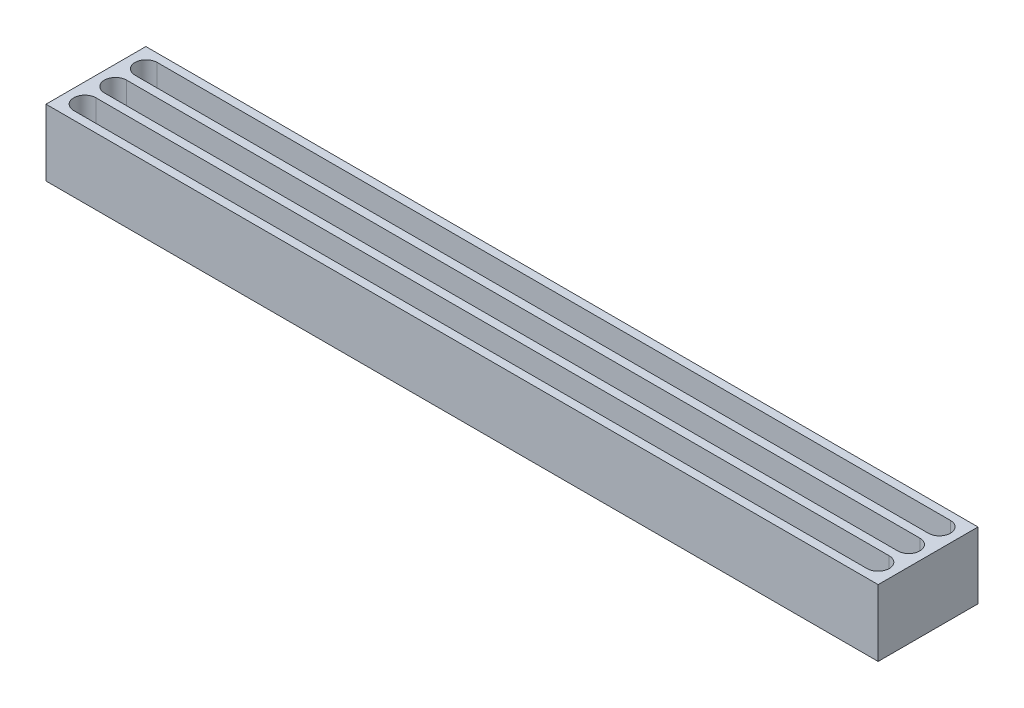
ISO-10303-21;
HEADER;
FILE_DESCRIPTION(('STEP AP214'),'2;1');
FILE_NAME('part.step','',(''),(''),'','','');
FILE_SCHEMA(('AUTOMOTIVE_DESIGN { 1 0 10303 214 1 1 1 1 }'));
ENDSEC;
DATA;
#1=APPLICATION_CONTEXT('core data for automotive mechanical design processes');
#2=APPLICATION_PROTOCOL_DEFINITION('international standard','automotive_design',2000,#1);
#3=PRODUCT_CONTEXT('',#1,'mechanical');
#4=PRODUCT('Part','Part','',(#3));
#5=PRODUCT_RELATED_PRODUCT_CATEGORY('part','',(#4));
#6=PRODUCT_DEFINITION_FORMATION('','',#4);
#7=PRODUCT_DEFINITION_CONTEXT('part definition',#1,'design');
#8=PRODUCT_DEFINITION('design','',#6,#7);
#9=PRODUCT_DEFINITION_SHAPE('','',#8);
#10=(LENGTH_UNIT() NAMED_UNIT(*) SI_UNIT(.MILLI.,.METRE.));
#11=(NAMED_UNIT(*) PLANE_ANGLE_UNIT() SI_UNIT($,.RADIAN.));
#12=(NAMED_UNIT(*) SI_UNIT($,.STERADIAN.) SOLID_ANGLE_UNIT());
#13=UNCERTAINTY_MEASURE_WITH_UNIT(LENGTH_MEASURE(1.E-05),#10,'distance_accuracy_value','');
#14=(GEOMETRIC_REPRESENTATION_CONTEXT(3) GLOBAL_UNCERTAINTY_ASSIGNED_CONTEXT((#13)) GLOBAL_UNIT_ASSIGNED_CONTEXT((#10,
#11,#12)) REPRESENTATION_CONTEXT('',''));
#15=CARTESIAN_POINT('',(0.,0.,0.));
#16=DIRECTION('',(0.,0.,1.));
#17=DIRECTION('',(1.,0.,0.));
#18=AXIS2_PLACEMENT_3D('',#15,#16,#17);
#19=CARTESIAN_POINT('',(-317.5,-50.8,38.1));
#20=DIRECTION('',(-1.,0.,0.));
#21=DIRECTION('',(0.,0.,1.));
#22=AXIS2_PLACEMENT_3D('',#19,#20,#21);
#23=PLANE('',#22);
#24=DIRECTION('',(0.,0.,1.));
#25=VECTOR('',#24,1.);
#26=CARTESIAN_POINT('',(-317.5,0.,38.1));
#27=LINE('',#26,#25);
#28=CARTESIAN_POINT('',(-317.5,0.,-38.1));
#29=VERTEX_POINT('',#28);
#30=CARTESIAN_POINT('',(-317.5,0.,38.1));
#31=VERTEX_POINT('',#30);
#32=EDGE_CURVE('E280',#29,#31,#27,.T.);
#33=ORIENTED_EDGE('',*,*,#32,.F.);
#34=DIRECTION('',(0.,1.,0.));
#35=VECTOR('',#34,1.);
#36=CARTESIAN_POINT('',(-317.5,-50.8,-38.1));
#37=LINE('',#36,#35);
#38=CARTESIAN_POINT('',(-317.5,-50.8,-38.1));
#39=VERTEX_POINT('',#38);
#40=EDGE_CURVE('E11',#39,#29,#37,.T.);
#41=ORIENTED_EDGE('',*,*,#40,.F.);
#42=DIRECTION('',(0.,0.,1.));
#43=VECTOR('',#42,1.);
#44=CARTESIAN_POINT('',(-317.5,-50.8,38.1));
#45=LINE('',#44,#43);
#46=CARTESIAN_POINT('',(-317.5,-50.8,38.1));
#47=VERTEX_POINT('',#46);
#48=EDGE_CURVE('E290',#39,#47,#45,.T.);
#49=ORIENTED_EDGE('',*,*,#48,.T.);
#50=DIRECTION('',(0.,1.,0.));
#51=VECTOR('',#50,1.);
#52=CARTESIAN_POINT('',(-317.5,-50.8,38.1));
#53=LINE('',#52,#51);
#54=EDGE_CURVE('E42',#47,#31,#53,.T.);
#55=ORIENTED_EDGE('',*,*,#54,.T.);
#56=EDGE_LOOP('',(#33,#41,#49,#55));
#57=FACE_BOUND('',#56,.T.);
#58=ADVANCED_FACE('F39',(#57),#23,.T.);
#59=CARTESIAN_POINT('',(317.5,-50.8,-38.1));
#60=DIRECTION('',(0.,0.,-1.));
#61=DIRECTION('',(-1.,0.,0.));
#62=AXIS2_PLACEMENT_3D('',#59,#60,#61);
#63=PLANE('',#62);
#64=DIRECTION('',(-1.,0.,0.));
#65=VECTOR('',#64,1.);
#66=CARTESIAN_POINT('',(317.5,0.,-38.1));
#67=LINE('',#66,#65);
#68=CARTESIAN_POINT('',(317.5,0.,-38.1));
#69=VERTEX_POINT('',#68);
#70=EDGE_CURVE('E295',#69,#29,#67,.T.);
#71=ORIENTED_EDGE('',*,*,#70,.F.);
#72=DIRECTION('',(0.,1.,0.));
#73=VECTOR('',#72,1.);
#74=CARTESIAN_POINT('',(317.5,-50.8,-38.1));
#75=LINE('',#74,#73);
#76=CARTESIAN_POINT('',(317.5,-50.8,-38.1));
#77=VERTEX_POINT('',#76);
#78=EDGE_CURVE('E48',#77,#69,#75,.T.);
#79=ORIENTED_EDGE('',*,*,#78,.F.);
#80=DIRECTION('',(-1.,0.,0.));
#81=VECTOR('',#80,1.);
#82=CARTESIAN_POINT('',(317.5,-50.8,-38.1));
#83=LINE('',#82,#81);
#84=EDGE_CURVE('E303',#77,#39,#83,.T.);
#85=ORIENTED_EDGE('',*,*,#84,.T.);
#86=ORIENTED_EDGE('',*,*,#40,.T.);
#87=EDGE_LOOP('',(#71,#79,#85,#86));
#88=FACE_BOUND('',#87,.T.);
#89=ADVANCED_FACE('F337',(#88),#63,.T.);
#90=CARTESIAN_POINT('',(317.5,-50.8,38.1));
#91=DIRECTION('',(1.,0.,0.));
#92=DIRECTION('',(0.,0.,-1.));
#93=AXIS2_PLACEMENT_3D('',#90,#91,#92);
#94=PLANE('',#93);
#95=DIRECTION('',(0.,0.,-1.));
#96=VECTOR('',#95,1.);
#97=CARTESIAN_POINT('',(317.5,0.,38.1));
#98=LINE('',#97,#96);
#99=CARTESIAN_POINT('',(317.5,0.,38.1));
#100=VERTEX_POINT('',#99);
#101=EDGE_CURVE('E314',#100,#69,#98,.T.);
#102=ORIENTED_EDGE('',*,*,#101,.F.);
#103=DIRECTION('',(0.,1.,0.));
#104=VECTOR('',#103,1.);
#105=CARTESIAN_POINT('',(317.5,-50.8,38.1));
#106=LINE('',#105,#104);
#107=CARTESIAN_POINT('',(317.5,-50.8,38.1));
#108=VERTEX_POINT('',#107);
#109=EDGE_CURVE('E322',#108,#100,#106,.T.);
#110=ORIENTED_EDGE('',*,*,#109,.F.);
#111=DIRECTION('',(0.,0.,-1.));
#112=VECTOR('',#111,1.);
#113=CARTESIAN_POINT('',(317.5,-50.8,38.1));
#114=LINE('',#113,#112);
#115=EDGE_CURVE('E299',#108,#77,#114,.T.);
#116=ORIENTED_EDGE('',*,*,#115,.T.);
#117=ORIENTED_EDGE('',*,*,#78,.T.);
#118=EDGE_LOOP('',(#102,#110,#116,#117));
#119=FACE_BOUND('',#118,.T.);
#120=ADVANCED_FACE('F342',(#119),#94,.T.);
#121=CARTESIAN_POINT('',(317.5,-50.8,38.1));
#122=DIRECTION('',(0.,0.,1.));
#123=DIRECTION('',(1.,0.,0.));
#124=AXIS2_PLACEMENT_3D('',#121,#122,#123);
#125=PLANE('',#124);
#126=DIRECTION('',(1.,0.,0.));
#127=VECTOR('',#126,1.);
#128=CARTESIAN_POINT('',(317.5,0.,38.1));
#129=LINE('',#128,#127);
#130=EDGE_CURVE('E310',#31,#100,#129,.T.);
#131=ORIENTED_EDGE('',*,*,#130,.F.);
#132=ORIENTED_EDGE('',*,*,#54,.F.);
#133=DIRECTION('',(1.,0.,0.));
#134=VECTOR('',#133,1.);
#135=CARTESIAN_POINT('',(317.5,-50.8,38.1));
#136=LINE('',#135,#134);
#137=EDGE_CURVE('E294',#47,#108,#136,.T.);
#138=ORIENTED_EDGE('',*,*,#137,.T.);
#139=ORIENTED_EDGE('',*,*,#109,.T.);
#140=EDGE_LOOP('',(#131,#132,#138,#139));
#141=FACE_BOUND('',#140,.T.);
#142=ADVANCED_FACE('F332',(#141),#125,.T.);
#143=CARTESIAN_POINT('',(0.,-50.8,0.));
#144=DIRECTION('',(0.,1.,0.));
#145=DIRECTION('',(0.,0.,1.));
#146=AXIS2_PLACEMENT_3D('',#143,#144,#145);
#147=PLANE('',#146);
#148=DIRECTION('',(1.,0.,0.));
#149=VECTOR('',#148,1.);
#150=CARTESIAN_POINT('',(302.683333333333,-50.8,-14.9860000000001));
#151=LINE('',#150,#149);
#152=CARTESIAN_POINT('',(-302.683333333333,-50.8,-14.986));
#153=VERTEX_POINT('',#152);
#154=CARTESIAN_POINT('',(302.683333333333,-50.8,-14.9860000000001));
#155=VERTEX_POINT('',#154);
#156=EDGE_CURVE('E162',#153,#155,#151,.T.);
#157=ORIENTED_EDGE('',*,*,#156,.T.);
#158=CARTESIAN_POINT('',(302.683333333333,-50.8,-23.4526666666667));
#159=DIRECTION('',(0.,1.,0.));
#160=DIRECTION('',(0.,0.,1.));
#161=AXIS2_PLACEMENT_3D('',#158,#159,#160);
#162=CIRCLE('',#161,8.46666666666667);
#163=CARTESIAN_POINT('',(302.683333333333,-50.8,-31.9193333333335));
#164=VERTEX_POINT('',#163);
#165=EDGE_CURVE('E155',#155,#164,#162,.T.);
#166=ORIENTED_EDGE('',*,*,#165,.T.);
#167=DIRECTION('',(-1.,0.,0.));
#168=VECTOR('',#167,1.);
#169=CARTESIAN_POINT('',(302.683333333333,-50.8,-31.9193333333335));
#170=LINE('',#169,#168);
#171=CARTESIAN_POINT('',(-302.683333333333,-50.8,-31.9193333333333));
#172=VERTEX_POINT('',#171);
#173=EDGE_CURVE('E165',#164,#172,#170,.T.);
#174=ORIENTED_EDGE('',*,*,#173,.T.);
#175=CARTESIAN_POINT('',(-302.683333333333,-50.8,-23.4526666666667));
#176=DIRECTION('',(0.,1.,0.));
#177=DIRECTION('',(0.,0.,1.));
#178=AXIS2_PLACEMENT_3D('',#175,#176,#177);
#179=CIRCLE('',#178,8.46666666666667);
#180=EDGE_CURVE('E56',#172,#153,#179,.T.);
#181=ORIENTED_EDGE('',*,*,#180,.T.);
#182=EDGE_LOOP('',(#157,#166,#174,#181));
#183=FACE_BOUND('',#182,.T.);
#184=DIRECTION('',(1.,0.,0.));
#185=VECTOR('',#184,1.);
#186=CARTESIAN_POINT('',(302.683333333333,-50.8,8.38199999999986));
#187=LINE('',#186,#185);
#188=CARTESIAN_POINT('',(-302.683333333333,-50.8,8.38200000000005));
#189=VERTEX_POINT('',#188);
#190=CARTESIAN_POINT('',(302.683333333333,-50.8,8.38199999999986));
#191=VERTEX_POINT('',#190);
#192=EDGE_CURVE('E215',#189,#191,#187,.T.);
#193=ORIENTED_EDGE('',*,*,#192,.T.);
#194=CARTESIAN_POINT('',(302.683333333333,-50.8,-0.0846666666666634));
#195=DIRECTION('',(0.,1.,0.));
#196=DIRECTION('',(0.,0.,1.));
#197=AXIS2_PLACEMENT_3D('',#194,#195,#196);
#198=CIRCLE('',#197,8.46666666666667);
#199=CARTESIAN_POINT('',(302.683333333333,-50.8,-8.55133333333349));
#200=VERTEX_POINT('',#199);
#201=EDGE_CURVE('E202',#191,#200,#198,.T.);
#202=ORIENTED_EDGE('',*,*,#201,.T.);
#203=DIRECTION('',(-1.,0.,0.));
#204=VECTOR('',#203,1.);
#205=CARTESIAN_POINT('',(302.683333333333,-50.8,-8.55133333333349));
#206=LINE('',#205,#204);
#207=CARTESIAN_POINT('',(-302.683333333333,-50.8,-8.5513333333333));
#208=VERTEX_POINT('',#207);
#209=EDGE_CURVE('E206',#200,#208,#206,.T.);
#210=ORIENTED_EDGE('',*,*,#209,.T.);
#211=CARTESIAN_POINT('',(-302.683333333333,-50.8,-0.0846666666666634));
#212=DIRECTION('',(0.,1.,0.));
#213=DIRECTION('',(0.,0.,1.));
#214=AXIS2_PLACEMENT_3D('',#211,#212,#213);
#215=CIRCLE('',#214,8.46666666666668);
#216=EDGE_CURVE('E211',#208,#189,#215,.T.);
#217=ORIENTED_EDGE('',*,*,#216,.T.);
#218=EDGE_LOOP('',(#193,#202,#210,#217));
#219=FACE_BOUND('',#218,.T.);
#220=DIRECTION('',(1.,0.,0.));
#221=VECTOR('',#220,1.);
#222=CARTESIAN_POINT('',(302.683333333333,-50.8,31.7499999999999));
#223=LINE('',#222,#221);
#224=CARTESIAN_POINT('',(-302.683333333333,-50.8,31.75));
#225=VERTEX_POINT('',#224);
#226=CARTESIAN_POINT('',(302.683333333333,-50.8,31.7499999999999));
#227=VERTEX_POINT('',#226);
#228=EDGE_CURVE('E259',#225,#227,#223,.T.);
#229=ORIENTED_EDGE('',*,*,#228,.T.);
#230=CARTESIAN_POINT('',(302.683333333333,-50.8,23.2833333333333));
#231=DIRECTION('',(0.,1.,0.));
#232=DIRECTION('',(0.,0.,1.));
#233=AXIS2_PLACEMENT_3D('',#230,#231,#232);
#234=CIRCLE('',#233,8.46666666666667);
#235=CARTESIAN_POINT('',(302.683333333333,-50.8,14.8166666666665));
#236=VERTEX_POINT('',#235);
#237=EDGE_CURVE('E246',#227,#236,#234,.T.);
#238=ORIENTED_EDGE('',*,*,#237,.T.);
#239=DIRECTION('',(-1.,0.,0.));
#240=VECTOR('',#239,1.);
#241=CARTESIAN_POINT('',(302.683333333333,-50.8,14.8166666666665));
#242=LINE('',#241,#240);
#243=CARTESIAN_POINT('',(-302.683333333333,-50.8,14.8166666666667));
#244=VERTEX_POINT('',#243);
#245=EDGE_CURVE('E250',#236,#244,#242,.T.);
#246=ORIENTED_EDGE('',*,*,#245,.T.);
#247=CARTESIAN_POINT('',(-302.683333333333,-50.8,23.2833333333333));
#248=DIRECTION('',(0.,1.,0.));
#249=DIRECTION('',(0.,0.,1.));
#250=AXIS2_PLACEMENT_3D('',#247,#248,#249);
#251=CIRCLE('',#250,8.46666666666668);
#252=EDGE_CURVE('E255',#244,#225,#251,.T.);
#253=ORIENTED_EDGE('',*,*,#252,.T.);
#254=EDGE_LOOP('',(#229,#238,#246,#253));
#255=FACE_BOUND('',#254,.T.);
#256=ORIENTED_EDGE('',*,*,#48,.F.);
#257=ORIENTED_EDGE('',*,*,#84,.F.);
#258=ORIENTED_EDGE('',*,*,#115,.F.);
#259=ORIENTED_EDGE('',*,*,#137,.F.);
#260=EDGE_LOOP('',(#256,#257,#258,#259));
#261=FACE_BOUND('',#260,.T.);
#262=ADVANCED_FACE('F170',(#183,#219,#255,#261),#147,.F.);
#263=CARTESIAN_POINT('',(0.,0.,0.));
#264=DIRECTION('',(0.,1.,0.));
#265=DIRECTION('',(0.,0.,1.));
#266=AXIS2_PLACEMENT_3D('',#263,#264,#265);
#267=PLANE('',#266);
#268=CARTESIAN_POINT('',(302.683333333333,0.,-23.4526666666667));
#269=DIRECTION('',(0.,1.,0.));
#270=DIRECTION('',(0.,0.,1.));
#271=AXIS2_PLACEMENT_3D('',#268,#269,#270);
#272=CIRCLE('',#271,8.46666666666667);
#273=CARTESIAN_POINT('',(302.683333333333,0.,-14.9860000000001));
#274=VERTEX_POINT('',#273);
#275=CARTESIAN_POINT('',(302.683333333333,0.,-31.9193333333335));
#276=VERTEX_POINT('',#275);
#277=EDGE_CURVE('E64',#274,#276,#272,.T.);
#278=ORIENTED_EDGE('',*,*,#277,.F.);
#279=DIRECTION('',(1.,0.,0.));
#280=VECTOR('',#279,1.);
#281=CARTESIAN_POINT('',(302.683333333333,0.,-14.9860000000001));
#282=LINE('',#281,#280);
#283=CARTESIAN_POINT('',(-302.683333333333,0.,-14.986));
#284=VERTEX_POINT('',#283);
#285=EDGE_CURVE('E174',#284,#274,#282,.T.);
#286=ORIENTED_EDGE('',*,*,#285,.F.);
#287=CARTESIAN_POINT('',(-302.683333333333,0.,-23.4526666666667));
#288=DIRECTION('',(0.,1.,0.));
#289=DIRECTION('',(0.,0.,1.));
#290=AXIS2_PLACEMENT_3D('',#287,#288,#289);
#291=CIRCLE('',#290,8.46666666666667);
#292=CARTESIAN_POINT('',(-302.683333333333,0.,-31.9193333333333));
#293=VERTEX_POINT('',#292);
#294=EDGE_CURVE('E178',#293,#284,#291,.T.);
#295=ORIENTED_EDGE('',*,*,#294,.F.);
#296=DIRECTION('',(-1.,0.,0.));
#297=VECTOR('',#296,1.);
#298=CARTESIAN_POINT('',(302.683333333333,0.,-31.9193333333335));
#299=LINE('',#298,#297);
#300=EDGE_CURVE('E187',#276,#293,#299,.T.);
#301=ORIENTED_EDGE('',*,*,#300,.F.);
#302=EDGE_LOOP('',(#278,#286,#295,#301));
#303=FACE_BOUND('',#302,.T.);
#304=CARTESIAN_POINT('',(302.683333333333,0.,-0.0846666666666634));
#305=DIRECTION('',(0.,1.,0.));
#306=DIRECTION('',(0.,0.,1.));
#307=AXIS2_PLACEMENT_3D('',#304,#305,#306);
#308=CIRCLE('',#307,8.46666666666667);
#309=CARTESIAN_POINT('',(302.683333333333,0.,8.38199999999986));
#310=VERTEX_POINT('',#309);
#311=CARTESIAN_POINT('',(302.683333333333,0.,-8.55133333333349));
#312=VERTEX_POINT('',#311);
#313=EDGE_CURVE('E196',#310,#312,#308,.T.);
#314=ORIENTED_EDGE('',*,*,#313,.F.);
#315=DIRECTION('',(1.,0.,0.));
#316=VECTOR('',#315,1.);
#317=CARTESIAN_POINT('',(302.683333333333,0.,8.38199999999986));
#318=LINE('',#317,#316);
#319=CARTESIAN_POINT('',(-302.683333333333,0.,8.38200000000005));
#320=VERTEX_POINT('',#319);
#321=EDGE_CURVE('E207',#320,#310,#318,.T.);
#322=ORIENTED_EDGE('',*,*,#321,.F.);
#323=CARTESIAN_POINT('',(-302.683333333333,0.,-0.0846666666666634));
#324=DIRECTION('',(0.,1.,0.));
#325=DIRECTION('',(0.,0.,1.));
#326=AXIS2_PLACEMENT_3D('',#323,#324,#325);
#327=CIRCLE('',#326,8.46666666666668);
#328=CARTESIAN_POINT('',(-302.683333333333,0.,-8.55133333333334));
#329=VERTEX_POINT('',#328);
#330=EDGE_CURVE('E226',#329,#320,#327,.T.);
#331=ORIENTED_EDGE('',*,*,#330,.F.);
#332=DIRECTION('',(-1.,0.,0.));
#333=VECTOR('',#332,1.);
#334=CARTESIAN_POINT('',(302.683333333333,0.,-8.55133333333349));
#335=LINE('',#334,#333);
#336=EDGE_CURVE('E222',#312,#329,#335,.T.);
#337=ORIENTED_EDGE('',*,*,#336,.F.);
#338=EDGE_LOOP('',(#314,#322,#331,#337));
#339=FACE_BOUND('',#338,.T.);
#340=CARTESIAN_POINT('',(302.683333333333,0.,23.2833333333333));
#341=DIRECTION('',(0.,1.,0.));
#342=DIRECTION('',(0.,0.,1.));
#343=AXIS2_PLACEMENT_3D('',#340,#341,#342);
#344=CIRCLE('',#343,8.46666666666667);
#345=CARTESIAN_POINT('',(302.683333333333,0.,31.7499999999999));
#346=VERTEX_POINT('',#345);
#347=CARTESIAN_POINT('',(302.683333333333,0.,14.8166666666665));
#348=VERTEX_POINT('',#347);
#349=EDGE_CURVE('E236',#346,#348,#344,.T.);
#350=ORIENTED_EDGE('',*,*,#349,.F.);
#351=DIRECTION('',(1.,0.,0.));
#352=VECTOR('',#351,1.);
#353=CARTESIAN_POINT('',(302.683333333333,0.,31.7499999999999));
#354=LINE('',#353,#352);
#355=CARTESIAN_POINT('',(-302.683333333333,0.,31.75));
#356=VERTEX_POINT('',#355);
#357=EDGE_CURVE('E251',#356,#346,#354,.T.);
#358=ORIENTED_EDGE('',*,*,#357,.F.);
#359=CARTESIAN_POINT('',(-302.683333333333,0.,23.2833333333333));
#360=DIRECTION('',(0.,1.,0.));
#361=DIRECTION('',(0.,0.,1.));
#362=AXIS2_PLACEMENT_3D('',#359,#360,#361);
#363=CIRCLE('',#362,8.46666666666668);
#364=CARTESIAN_POINT('',(-302.683333333333,0.,14.8166666666667));
#365=VERTEX_POINT('',#364);
#366=EDGE_CURVE('E270',#365,#356,#363,.T.);
#367=ORIENTED_EDGE('',*,*,#366,.F.);
#368=DIRECTION('',(-1.,0.,0.));
#369=VECTOR('',#368,1.);
#370=CARTESIAN_POINT('',(302.683333333333,0.,14.8166666666665));
#371=LINE('',#370,#369);
#372=EDGE_CURVE('E266',#348,#365,#371,.T.);
#373=ORIENTED_EDGE('',*,*,#372,.F.);
#374=EDGE_LOOP('',(#350,#358,#367,#373));
#375=FACE_BOUND('',#374,.T.);
#376=ORIENTED_EDGE('',*,*,#32,.T.);
#377=ORIENTED_EDGE('',*,*,#130,.T.);
#378=ORIENTED_EDGE('',*,*,#101,.T.);
#379=ORIENTED_EDGE('',*,*,#70,.T.);
#380=EDGE_LOOP('',(#376,#377,#378,#379));
#381=FACE_BOUND('',#380,.T.);
#382=ADVANCED_FACE('F334',(#303,#339,#375,#381),#267,.T.);
#383=CARTESIAN_POINT('',(302.683333333333,-50.8,23.2833333333333));
#384=DIRECTION('',(0.,1.,0.));
#385=DIRECTION('',(0.,0.,1.));
#386=AXIS2_PLACEMENT_3D('',#383,#384,#385);
#387=CYLINDRICAL_SURFACE('',#386,8.46666666666667);
#388=ORIENTED_EDGE('',*,*,#349,.T.);
#389=DIRECTION('',(0.,1.,0.));
#390=VECTOR('',#389,1.);
#391=CARTESIAN_POINT('',(302.683333333333,-50.8,14.8166666666665));
#392=LINE('',#391,#390);
#393=EDGE_CURVE('E263',#236,#348,#392,.T.);
#394=ORIENTED_EDGE('',*,*,#393,.F.);
#395=ORIENTED_EDGE('',*,*,#237,.F.);
#396=DIRECTION('',(0.,1.,0.));
#397=VECTOR('',#396,1.);
#398=CARTESIAN_POINT('',(302.683333333333,-50.8,31.7499999999999));
#399=LINE('',#398,#397);
#400=EDGE_CURVE('E277',#227,#346,#399,.T.);
#401=ORIENTED_EDGE('',*,*,#400,.T.);
#402=EDGE_LOOP('',(#388,#394,#395,#401));
#403=FACE_BOUND('',#402,.T.);
#404=ADVANCED_FACE('F384',(#403),#387,.F.);
#405=CARTESIAN_POINT('',(302.683333333333,-50.8,31.7499999999999));
#406=DIRECTION('',(0.,0.,1.));
#407=DIRECTION('',(1.,0.,0.));
#408=AXIS2_PLACEMENT_3D('',#405,#406,#407);
#409=PLANE('',#408);
#410=ORIENTED_EDGE('',*,*,#357,.T.);
#411=ORIENTED_EDGE('',*,*,#400,.F.);
#412=ORIENTED_EDGE('',*,*,#228,.F.);
#413=DIRECTION('',(0.,1.,0.));
#414=VECTOR('',#413,1.);
#415=CARTESIAN_POINT('',(-302.683333333333,-50.8,31.75));
#416=LINE('',#415,#414);
#417=EDGE_CURVE('E281',#225,#356,#416,.T.);
#418=ORIENTED_EDGE('',*,*,#417,.T.);
#419=EDGE_LOOP('',(#410,#411,#412,#418));
#420=FACE_BOUND('',#419,.T.);
#421=ADVANCED_FACE('F394',(#420),#409,.F.);
#422=CARTESIAN_POINT('',(-302.683333333333,-50.8,23.2833333333333));
#423=DIRECTION('',(0.,1.,0.));
#424=DIRECTION('',(0.,0.,1.));
#425=AXIS2_PLACEMENT_3D('',#422,#423,#424);
#426=CYLINDRICAL_SURFACE('',#425,8.46666666666668);
#427=ORIENTED_EDGE('',*,*,#366,.T.);
#428=ORIENTED_EDGE('',*,*,#417,.F.);
#429=ORIENTED_EDGE('',*,*,#252,.F.);
#430=DIRECTION('',(0.,1.,0.));
#431=VECTOR('',#430,1.);
#432=CARTESIAN_POINT('',(-302.683333333333,-50.8,14.8166666666667));
#433=LINE('',#432,#431);
#434=EDGE_CURVE('E284',#244,#365,#433,.T.);
#435=ORIENTED_EDGE('',*,*,#434,.T.);
#436=EDGE_LOOP('',(#427,#428,#429,#435));
#437=FACE_BOUND('',#436,.T.);
#438=ADVANCED_FACE('F404',(#437),#426,.F.);
#439=CARTESIAN_POINT('',(302.683333333333,-50.8,14.8166666666665));
#440=DIRECTION('',(0.,0.,-1.));
#441=DIRECTION('',(-1.,0.,0.));
#442=AXIS2_PLACEMENT_3D('',#439,#440,#441);
#443=PLANE('',#442);
#444=ORIENTED_EDGE('',*,*,#372,.T.);
#445=ORIENTED_EDGE('',*,*,#434,.F.);
#446=ORIENTED_EDGE('',*,*,#245,.F.);
#447=ORIENTED_EDGE('',*,*,#393,.T.);
#448=EDGE_LOOP('',(#444,#445,#446,#447));
#449=FACE_BOUND('',#448,.T.);
#450=ADVANCED_FACE('F414',(#449),#443,.F.);
#451=CARTESIAN_POINT('',(302.683333333333,-50.8,-0.0846666666666634));
#452=DIRECTION('',(0.,1.,0.));
#453=DIRECTION('',(0.,0.,1.));
#454=AXIS2_PLACEMENT_3D('',#451,#452,#453);
#455=CYLINDRICAL_SURFACE('',#454,8.46666666666667);
#456=ORIENTED_EDGE('',*,*,#313,.T.);
#457=DIRECTION('',(0.,1.,0.));
#458=VECTOR('',#457,1.);
#459=CARTESIAN_POINT('',(302.683333333333,-50.8,-8.55133333333349));
#460=LINE('',#459,#458);
#461=EDGE_CURVE('E219',#200,#312,#460,.T.);
#462=ORIENTED_EDGE('',*,*,#461,.F.);
#463=ORIENTED_EDGE('',*,*,#201,.F.);
#464=DIRECTION('',(0.,1.,0.));
#465=VECTOR('',#464,1.);
#466=CARTESIAN_POINT('',(302.683333333333,-50.8,8.38199999999986));
#467=LINE('',#466,#465);
#468=EDGE_CURVE('E233',#191,#310,#467,.T.);
#469=ORIENTED_EDGE('',*,*,#468,.T.);
#470=EDGE_LOOP('',(#456,#462,#463,#469));
#471=FACE_BOUND('',#470,.T.);
#472=ADVANCED_FACE('F424',(#471),#455,.F.);
#473=CARTESIAN_POINT('',(302.683333333333,-50.8,8.38199999999986));
#474=DIRECTION('',(0.,0.,1.));
#475=DIRECTION('',(1.,0.,0.));
#476=AXIS2_PLACEMENT_3D('',#473,#474,#475);
#477=PLANE('',#476);
#478=ORIENTED_EDGE('',*,*,#321,.T.);
#479=ORIENTED_EDGE('',*,*,#468,.F.);
#480=ORIENTED_EDGE('',*,*,#192,.F.);
#481=DIRECTION('',(0.,1.,0.));
#482=VECTOR('',#481,1.);
#483=CARTESIAN_POINT('',(-302.683333333333,-50.8,8.38200000000005));
#484=LINE('',#483,#482);
#485=EDGE_CURVE('E237',#189,#320,#484,.T.);
#486=ORIENTED_EDGE('',*,*,#485,.T.);
#487=EDGE_LOOP('',(#478,#479,#480,#486));
#488=FACE_BOUND('',#487,.T.);
#489=ADVANCED_FACE('F434',(#488),#477,.F.);
#490=CARTESIAN_POINT('',(-302.683333333333,-50.8,-0.0846666666666634));
#491=DIRECTION('',(0.,1.,0.));
#492=DIRECTION('',(0.,0.,1.));
#493=AXIS2_PLACEMENT_3D('',#490,#491,#492);
#494=CYLINDRICAL_SURFACE('',#493,8.46666666666668);
#495=ORIENTED_EDGE('',*,*,#330,.T.);
#496=ORIENTED_EDGE('',*,*,#485,.F.);
#497=ORIENTED_EDGE('',*,*,#216,.F.);
#498=DIRECTION('',(0.,1.,0.));
#499=VECTOR('',#498,1.);
#500=CARTESIAN_POINT('',(-302.683333333333,-50.8,-8.55133333333334));
#501=LINE('',#500,#499);
#502=EDGE_CURVE('E240',#208,#329,#501,.T.);
#503=ORIENTED_EDGE('',*,*,#502,.T.);
#504=EDGE_LOOP('',(#495,#496,#497,#503));
#505=FACE_BOUND('',#504,.T.);
#506=ADVANCED_FACE('F444',(#505),#494,.F.);
#507=CARTESIAN_POINT('',(302.683333333333,-50.8,-8.55133333333349));
#508=DIRECTION('',(0.,0.,-1.));
#509=DIRECTION('',(-1.,0.,0.));
#510=AXIS2_PLACEMENT_3D('',#507,#508,#509);
#511=PLANE('',#510);
#512=ORIENTED_EDGE('',*,*,#336,.T.);
#513=ORIENTED_EDGE('',*,*,#502,.F.);
#514=ORIENTED_EDGE('',*,*,#209,.F.);
#515=ORIENTED_EDGE('',*,*,#461,.T.);
#516=EDGE_LOOP('',(#512,#513,#514,#515));
#517=FACE_BOUND('',#516,.T.);
#518=ADVANCED_FACE('F454',(#517),#511,.F.);
#519=CARTESIAN_POINT('',(302.683333333333,-50.8,-23.4526666666667));
#520=DIRECTION('',(0.,1.,0.));
#521=DIRECTION('',(0.,0.,1.));
#522=AXIS2_PLACEMENT_3D('',#519,#520,#521);
#523=CYLINDRICAL_SURFACE('',#522,8.46666666666667);
#524=ORIENTED_EDGE('',*,*,#277,.T.);
#525=DIRECTION('',(0.,1.,0.));
#526=VECTOR('',#525,1.);
#527=CARTESIAN_POINT('',(302.683333333333,-50.8,-31.9193333333335));
#528=LINE('',#527,#526);
#529=EDGE_CURVE('E151',#164,#276,#528,.T.);
#530=ORIENTED_EDGE('',*,*,#529,.F.);
#531=ORIENTED_EDGE('',*,*,#165,.F.);
#532=DIRECTION('',(0.,1.,0.));
#533=VECTOR('',#532,1.);
#534=CARTESIAN_POINT('',(302.683333333333,-50.8,-14.9860000000001));
#535=LINE('',#534,#533);
#536=EDGE_CURVE('E193',#155,#274,#535,.T.);
#537=ORIENTED_EDGE('',*,*,#536,.T.);
#538=EDGE_LOOP('',(#524,#530,#531,#537));
#539=FACE_BOUND('',#538,.T.);
#540=ADVANCED_FACE('F153',(#539),#523,.F.);
#541=CARTESIAN_POINT('',(302.683333333333,-50.8,-14.9860000000001));
#542=DIRECTION('',(0.,0.,1.));
#543=DIRECTION('',(1.,0.,0.));
#544=AXIS2_PLACEMENT_3D('',#541,#542,#543);
#545=PLANE('',#544);
#546=ORIENTED_EDGE('',*,*,#285,.T.);
#547=ORIENTED_EDGE('',*,*,#536,.F.);
#548=ORIENTED_EDGE('',*,*,#156,.F.);
#549=DIRECTION('',(0.,1.,0.));
#550=VECTOR('',#549,1.);
#551=CARTESIAN_POINT('',(-302.683333333333,-50.8,-14.986));
#552=LINE('',#551,#550);
#553=EDGE_CURVE('E197',#153,#284,#552,.T.);
#554=ORIENTED_EDGE('',*,*,#553,.T.);
#555=EDGE_LOOP('',(#546,#547,#548,#554));
#556=FACE_BOUND('',#555,.T.);
#557=ADVANCED_FACE('F473',(#556),#545,.F.);
#558=CARTESIAN_POINT('',(-302.683333333333,-50.8,-23.4526666666667));
#559=DIRECTION('',(0.,1.,0.));
#560=DIRECTION('',(0.,0.,1.));
#561=AXIS2_PLACEMENT_3D('',#558,#559,#560);
#562=CYLINDRICAL_SURFACE('',#561,8.46666666666667);
#563=ORIENTED_EDGE('',*,*,#294,.T.);
#564=ORIENTED_EDGE('',*,*,#553,.F.);
#565=ORIENTED_EDGE('',*,*,#180,.F.);
#566=DIRECTION('',(0.,1.,0.));
#567=VECTOR('',#566,1.);
#568=CARTESIAN_POINT('',(-302.683333333333,-50.8,-31.9193333333333));
#569=LINE('',#568,#567);
#570=EDGE_CURVE('E161',#172,#293,#569,.T.);
#571=ORIENTED_EDGE('',*,*,#570,.T.);
#572=EDGE_LOOP('',(#563,#564,#565,#571));
#573=FACE_BOUND('',#572,.T.);
#574=ADVANCED_FACE('F482',(#573),#562,.F.);
#575=CARTESIAN_POINT('',(302.683333333333,-50.8,-31.9193333333335));
#576=DIRECTION('',(0.,0.,-1.));
#577=DIRECTION('',(-1.,0.,0.));
#578=AXIS2_PLACEMENT_3D('',#575,#576,#577);
#579=PLANE('',#578);
#580=ORIENTED_EDGE('',*,*,#300,.T.);
#581=ORIENTED_EDGE('',*,*,#570,.F.);
#582=ORIENTED_EDGE('',*,*,#173,.F.);
#583=ORIENTED_EDGE('',*,*,#529,.T.);
#584=EDGE_LOOP('',(#580,#581,#582,#583));
#585=FACE_BOUND('',#584,.T.);
#586=ADVANCED_FACE('F166',(#585),#579,.F.);
#587=CLOSED_SHELL('',(#58,#89,#120,#142,#262,#382,#404,#421,#438,#450,#472,#489,#506,#518,#540,
#557,#574,#586));
#588=MANIFOLD_SOLID_BREP('B2',#587);
#589=ADVANCED_BREP_SHAPE_REPRESENTATION('',(#18,#588),#14);
#590=SHAPE_DEFINITION_REPRESENTATION(#9,#589);
ENDSEC;
END-ISO-10303-21;
